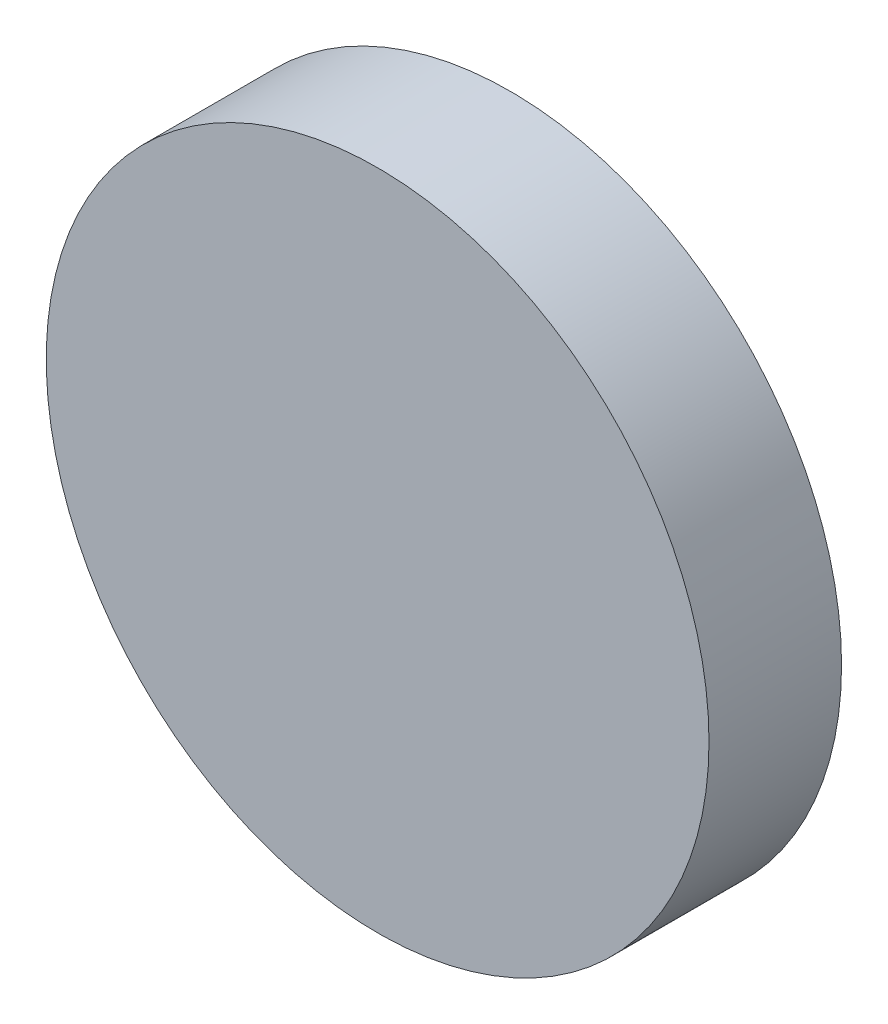
ISO-10303-21;
HEADER;
FILE_DESCRIPTION(('STEP AP214'),'2;1');
FILE_NAME('part.step','',(''),(''),'','','');
FILE_SCHEMA(('AUTOMOTIVE_DESIGN { 1 0 10303 214 1 1 1 1 }'));
ENDSEC;
DATA;
#1=APPLICATION_CONTEXT('core data for automotive mechanical design processes');
#2=APPLICATION_PROTOCOL_DEFINITION('international standard','automotive_design',2000,#1);
#3=PRODUCT_CONTEXT('',#1,'mechanical');
#4=PRODUCT('Part','Part','',(#3));
#5=PRODUCT_RELATED_PRODUCT_CATEGORY('part','',(#4));
#6=PRODUCT_DEFINITION_FORMATION('','',#4);
#7=PRODUCT_DEFINITION_CONTEXT('part definition',#1,'design');
#8=PRODUCT_DEFINITION('design','',#6,#7);
#9=PRODUCT_DEFINITION_SHAPE('','',#8);
#10=(LENGTH_UNIT() NAMED_UNIT(*) SI_UNIT(.MILLI.,.METRE.));
#11=(NAMED_UNIT(*) PLANE_ANGLE_UNIT() SI_UNIT($,.RADIAN.));
#12=(NAMED_UNIT(*) SI_UNIT($,.STERADIAN.) SOLID_ANGLE_UNIT());
#13=UNCERTAINTY_MEASURE_WITH_UNIT(LENGTH_MEASURE(1.E-05),#10,'distance_accuracy_value','');
#14=(GEOMETRIC_REPRESENTATION_CONTEXT(3) GLOBAL_UNCERTAINTY_ASSIGNED_CONTEXT((#13)) GLOBAL_UNIT_ASSIGNED_CONTEXT((#10,
#11,#12)) REPRESENTATION_CONTEXT('',''));
#15=CARTESIAN_POINT('',(0.,0.,0.));
#16=DIRECTION('',(0.,0.,1.));
#17=DIRECTION('',(1.,0.,0.));
#18=AXIS2_PLACEMENT_3D('',#15,#16,#17);
#19=CARTESIAN_POINT('',(0.,0.,1.));
#20=DIRECTION('',(0.,0.,-1.));
#21=DIRECTION('',(-1.,0.,0.));
#22=AXIS2_PLACEMENT_3D('',#19,#20,#21);
#23=CYLINDRICAL_SURFACE('',#22,2.5);
#24=CARTESIAN_POINT('',(0.,0.,1.));
#25=DIRECTION('',(0.,0.,1.));
#26=DIRECTION('',(1.,0.,0.));
#27=AXIS2_PLACEMENT_3D('',#24,#25,#26);
#28=CIRCLE('',#27,2.5);
#29=CARTESIAN_POINT('',(2.5,0.,1.));
#30=VERTEX_POINT('',#29);
#31=EDGE_CURVE('E10',#30,#30,#28,.T.);
#32=ORIENTED_EDGE('',*,*,#31,.F.);
#33=EDGE_LOOP('',(#32));
#34=FACE_BOUND('',#33,.T.);
#35=CARTESIAN_POINT('',(0.,0.,0.));
#36=DIRECTION('',(0.,0.,1.));
#37=DIRECTION('',(1.,0.,0.));
#38=AXIS2_PLACEMENT_3D('',#35,#36,#37);
#39=CIRCLE('',#38,2.5);
#40=CARTESIAN_POINT('',(2.5,0.,0.));
#41=VERTEX_POINT('',#40);
#42=EDGE_CURVE('E40',#41,#41,#39,.T.);
#43=ORIENTED_EDGE('',*,*,#42,.T.);
#44=EDGE_LOOP('',(#43));
#45=FACE_BOUND('',#44,.T.);
#46=ADVANCED_FACE('F37',(#34,#45),#23,.T.);
#47=CARTESIAN_POINT('',(0.,0.,1.));
#48=DIRECTION('',(0.,0.,1.));
#49=DIRECTION('',(1.,0.,0.));
#50=AXIS2_PLACEMENT_3D('',#47,#48,#49);
#51=PLANE('',#50);
#52=ORIENTED_EDGE('',*,*,#31,.T.);
#53=EDGE_LOOP('',(#52));
#54=FACE_BOUND('',#53,.T.);
#55=ADVANCED_FACE('F54',(#54),#51,.T.);
#56=CARTESIAN_POINT('',(0.,0.,0.));
#57=DIRECTION('',(0.,0.,1.));
#58=DIRECTION('',(1.,0.,0.));
#59=AXIS2_PLACEMENT_3D('',#56,#57,#58);
#60=PLANE('',#59);
#61=ORIENTED_EDGE('',*,*,#42,.F.);
#62=EDGE_LOOP('',(#61));
#63=FACE_BOUND('',#62,.T.);
#64=ADVANCED_FACE('F52',(#63),#60,.F.);
#65=CLOSED_SHELL('',(#46,#55,#64));
#66=MANIFOLD_SOLID_BREP('B2',#65);
#67=ADVANCED_BREP_SHAPE_REPRESENTATION('',(#18,#66),#14);
#68=SHAPE_DEFINITION_REPRESENTATION(#9,#67);
ENDSEC;
END-ISO-10303-21;
